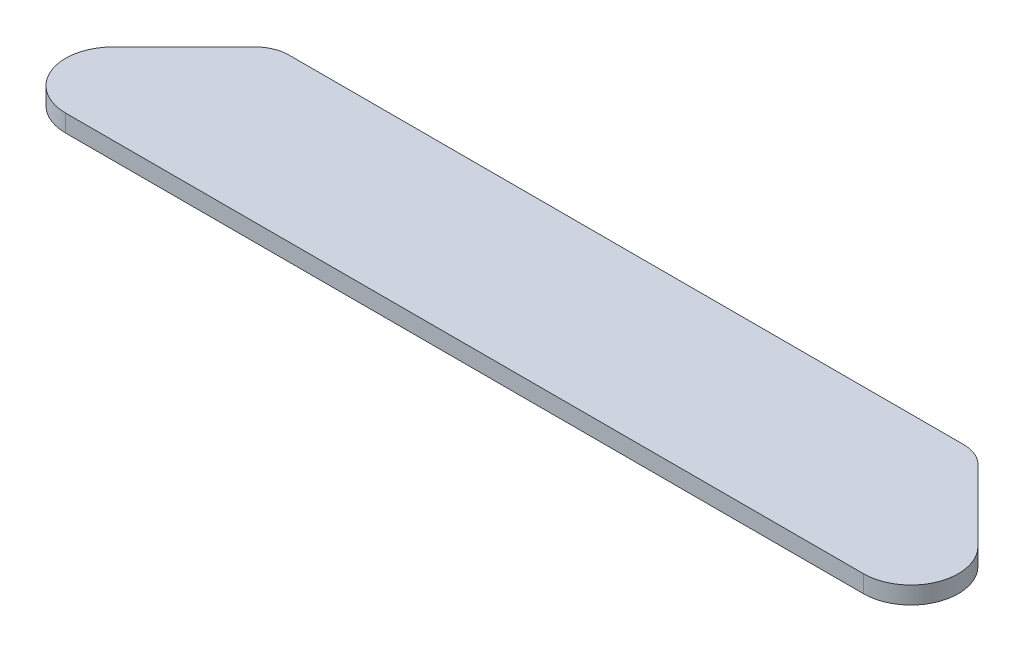
ISO-10303-21;
HEADER;
FILE_DESCRIPTION(('STEP AP214'),'2;1');
FILE_NAME('part.step','',(''),(''),'','','');
FILE_SCHEMA(('AUTOMOTIVE_DESIGN { 1 0 10303 214 1 1 1 1 }'));
ENDSEC;
DATA;
#1=APPLICATION_CONTEXT('core data for automotive mechanical design processes');
#2=APPLICATION_PROTOCOL_DEFINITION('international standard','automotive_design',2000,#1);
#3=PRODUCT_CONTEXT('',#1,'mechanical');
#4=PRODUCT('Part','Part','',(#3));
#5=PRODUCT_RELATED_PRODUCT_CATEGORY('part','',(#4));
#6=PRODUCT_DEFINITION_FORMATION('','',#4);
#7=PRODUCT_DEFINITION_CONTEXT('part definition',#1,'design');
#8=PRODUCT_DEFINITION('design','',#6,#7);
#9=PRODUCT_DEFINITION_SHAPE('','',#8);
#10=(LENGTH_UNIT() NAMED_UNIT(*) SI_UNIT(.MILLI.,.METRE.));
#11=(NAMED_UNIT(*) PLANE_ANGLE_UNIT() SI_UNIT($,.RADIAN.));
#12=(NAMED_UNIT(*) SI_UNIT($,.STERADIAN.) SOLID_ANGLE_UNIT());
#13=UNCERTAINTY_MEASURE_WITH_UNIT(LENGTH_MEASURE(1.E-05),#10,'distance_accuracy_value','');
#14=(GEOMETRIC_REPRESENTATION_CONTEXT(3) GLOBAL_UNCERTAINTY_ASSIGNED_CONTEXT((#13)) GLOBAL_UNIT_ASSIGNED_CONTEXT((#10,
#11,#12)) REPRESENTATION_CONTEXT('',''));
#15=CARTESIAN_POINT('',(0.,0.,0.));
#16=DIRECTION('',(0.,0.,1.));
#17=DIRECTION('',(1.,0.,0.));
#18=AXIS2_PLACEMENT_3D('',#15,#16,#17);
#19=CARTESIAN_POINT('',(-933.90710257734,38.1,58.4000267443762));
#20=DIRECTION('',(0.,-1.,0.));
#21=DIRECTION('',(0.,0.,-1.));
#22=AXIS2_PLACEMENT_3D('',#19,#20,#21);
#23=CYLINDRICAL_SURFACE('',#22,104.14);
#24=CARTESIAN_POINT('',(-933.90710257734,0.,58.4000267443762));
#25=DIRECTION('',(0.,1.,0.));
#26=DIRECTION('',(0.,0.,-1.));
#27=AXIS2_PLACEMENT_3D('',#24,#25,#26);
#28=CIRCLE('',#27,104.14);
#29=CARTESIAN_POINT('',(-1007.54520277011,0.,-15.2380734483907));
#30=VERTEX_POINT('',#29);
#31=CARTESIAN_POINT('',(-933.90710257734,0.,162.540026744376));
#32=VERTEX_POINT('',#31);
#33=EDGE_CURVE('E134',#30,#32,#28,.T.);
#34=ORIENTED_EDGE('',*,*,#33,.T.);
#35=DIRECTION('',(0.,-1.,0.));
#36=VECTOR('',#35,1.);
#37=CARTESIAN_POINT('',(-933.90710257734,38.1,162.540026744376));
#38=LINE('',#37,#36);
#39=CARTESIAN_POINT('',(-933.90710257734,38.1,162.540026744376));
#40=VERTEX_POINT('',#39);
#41=EDGE_CURVE('E41',#40,#32,#38,.T.);
#42=ORIENTED_EDGE('',*,*,#41,.F.);
#43=CARTESIAN_POINT('',(-933.90710257734,38.1,58.4000267443762));
#44=DIRECTION('',(0.,1.,0.));
#45=DIRECTION('',(0.,0.,-1.));
#46=AXIS2_PLACEMENT_3D('',#43,#44,#45);
#47=CIRCLE('',#46,104.14);
#48=CARTESIAN_POINT('',(-1007.54520277011,38.1,-15.2380734483907));
#49=VERTEX_POINT('',#48);
#50=EDGE_CURVE('E93',#49,#40,#47,.T.);
#51=ORIENTED_EDGE('',*,*,#50,.F.);
#52=DIRECTION('',(0.,-1.,0.));
#53=VECTOR('',#52,1.);
#54=CARTESIAN_POINT('',(-1007.54520277011,38.1,-15.2380734483907));
#55=LINE('',#54,#53);
#56=EDGE_CURVE('E11',#49,#30,#55,.T.);
#57=ORIENTED_EDGE('',*,*,#56,.T.);
#58=EDGE_LOOP('',(#34,#42,#51,#57));
#59=FACE_BOUND('',#58,.T.);
#60=ADVANCED_FACE('F33',(#59),#23,.T.);
#61=CARTESIAN_POINT('',(812.279191117721,38.1,162.540026744376));
#62=DIRECTION('',(0.,0.,-1.));
#63=DIRECTION('',(-1.,0.,0.));
#64=AXIS2_PLACEMENT_3D('',#61,#62,#63);
#65=PLANE('',#64);
#66=DIRECTION('',(1.,0.,0.));
#67=VECTOR('',#66,1.);
#68=CARTESIAN_POINT('',(812.279191117721,0.,162.540026744376));
#69=LINE('',#68,#67);
#70=CARTESIAN_POINT('',(818.411293566149,0.,162.540026744376));
#71=VERTEX_POINT('',#70);
#72=EDGE_CURVE('E137',#32,#71,#69,.T.);
#73=ORIENTED_EDGE('',*,*,#72,.T.);
#74=DIRECTION('',(0.,-1.,0.));
#75=VECTOR('',#74,1.);
#76=CARTESIAN_POINT('',(818.411293566149,38.1,162.540026744376));
#77=LINE('',#76,#75);
#78=CARTESIAN_POINT('',(818.411293566149,38.1,162.540026744376));
#79=VERTEX_POINT('',#78);
#80=EDGE_CURVE('E155',#79,#71,#77,.T.);
#81=ORIENTED_EDGE('',*,*,#80,.F.);
#82=DIRECTION('',(1.,0.,0.));
#83=VECTOR('',#82,1.);
#84=CARTESIAN_POINT('',(-927.775000128912,38.1,162.540026744376));
#85=LINE('',#84,#83);
#86=EDGE_CURVE('E162',#40,#79,#85,.T.);
#87=ORIENTED_EDGE('',*,*,#86,.F.);
#88=ORIENTED_EDGE('',*,*,#41,.T.);
#89=EDGE_LOOP('',(#73,#81,#87,#88));
#90=FACE_BOUND('',#89,.T.);
#91=ADVANCED_FACE('F160',(#90),#65,.F.);
#92=CARTESIAN_POINT('',(818.411293566152,38.1,58.4000267443759));
#93=DIRECTION('',(0.,-1.,0.));
#94=DIRECTION('',(0.,0.,-1.));
#95=AXIS2_PLACEMENT_3D('',#92,#93,#94);
#96=CYLINDRICAL_SURFACE('',#95,104.14);
#97=CARTESIAN_POINT('',(818.411293566152,0.,58.4000267443759));
#98=DIRECTION('',(0.,1.,0.));
#99=DIRECTION('',(0.,0.,-1.));
#100=AXIS2_PLACEMENT_3D('',#97,#98,#99);
#101=CIRCLE('',#100,104.14);
#102=CARTESIAN_POINT('',(892.049393758918,0.,-15.2380734483918));
#103=VERTEX_POINT('',#102);
#104=EDGE_CURVE('E140',#71,#103,#101,.T.);
#105=ORIENTED_EDGE('',*,*,#104,.T.);
#106=DIRECTION('',(0.,-1.,0.));
#107=VECTOR('',#106,1.);
#108=CARTESIAN_POINT('',(892.049393758918,38.1,-15.2380734483918));
#109=LINE('',#108,#107);
#110=CARTESIAN_POINT('',(892.049393758918,38.1,-15.2380734483918));
#111=VERTEX_POINT('',#110);
#112=EDGE_CURVE('E152',#111,#103,#109,.T.);
#113=ORIENTED_EDGE('',*,*,#112,.F.);
#114=CARTESIAN_POINT('',(818.411293566152,38.1,58.4000267443759));
#115=DIRECTION('',(0.,1.,0.));
#116=DIRECTION('',(0.,0.,-1.));
#117=AXIS2_PLACEMENT_3D('',#114,#115,#116);
#118=CIRCLE('',#117,104.14);
#119=EDGE_CURVE('E172',#79,#111,#118,.T.);
#120=ORIENTED_EDGE('',*,*,#119,.F.);
#121=ORIENTED_EDGE('',*,*,#80,.T.);
#122=EDGE_LOOP('',(#105,#113,#120,#121));
#123=FACE_BOUND('',#122,.T.);
#124=ADVANCED_FACE('F168',(#123),#96,.T.);
#125=CARTESIAN_POINT('',(892.049393758918,38.1,-15.2380734483918));
#126=DIRECTION('',(-0.707106781186538,0.,0.707106781186557));
#127=DIRECTION('',(0.707106781186557,0.,0.707106781186538));
#128=AXIS2_PLACEMENT_3D('',#125,#126,#127);
#129=PLANE('',#128);
#130=DIRECTION('',(-0.707106781186557,0.,-0.707106781186538));
#131=VECTOR('',#130,1.);
#132=CARTESIAN_POINT('',(892.049393758918,0.,-15.2380734483918));
#133=LINE('',#132,#131);
#134=CARTESIAN_POINT('',(736.545957225267,0.,-170.741509982039));
#135=VERTEX_POINT('',#134);
#136=EDGE_CURVE('E142',#103,#135,#133,.T.);
#137=ORIENTED_EDGE('',*,*,#136,.T.);
#138=DIRECTION('',(0.,-1.,0.));
#139=VECTOR('',#138,1.);
#140=CARTESIAN_POINT('',(736.545957225267,38.1,-170.741509982039));
#141=LINE('',#140,#139);
#142=CARTESIAN_POINT('',(736.545957225267,38.1,-170.741509982039));
#143=VERTEX_POINT('',#142);
#144=EDGE_CURVE('E123',#143,#135,#141,.T.);
#145=ORIENTED_EDGE('',*,*,#144,.F.);
#146=DIRECTION('',(-0.707106781186557,0.,-0.707106781186538));
#147=VECTOR('',#146,1.);
#148=CARTESIAN_POINT('',(892.049393758918,38.1,-15.2380734483918));
#149=LINE('',#148,#147);
#150=EDGE_CURVE('E113',#111,#143,#149,.T.);
#151=ORIENTED_EDGE('',*,*,#150,.F.);
#152=ORIENTED_EDGE('',*,*,#112,.T.);
#153=EDGE_LOOP('',(#137,#145,#151,#152));
#154=FACE_BOUND('',#153,.T.);
#155=ADVANCED_FACE('F171',(#154),#129,.F.);
#156=CARTESIAN_POINT('',(682.664420498853,38.1,-116.859973255624));
#157=DIRECTION('',(0.,-1.,0.));
#158=DIRECTION('',(0.,0.,-1.));
#159=AXIS2_PLACEMENT_3D('',#156,#157,#158);
#160=CYLINDRICAL_SURFACE('',#159,76.1999999999997);
#161=CARTESIAN_POINT('',(682.664420498853,0.,-116.859973255624));
#162=DIRECTION('',(0.,1.,0.));
#163=DIRECTION('',(0.,0.,-1.));
#164=AXIS2_PLACEMENT_3D('',#161,#162,#163);
#165=CIRCLE('',#164,76.1999999999997);
#166=CARTESIAN_POINT('',(682.664420498853,0.,-193.059973255624));
#167=VERTEX_POINT('',#166);
#168=EDGE_CURVE('E122',#135,#167,#165,.T.);
#169=ORIENTED_EDGE('',*,*,#168,.T.);
#170=DIRECTION('',(0.,-1.,0.));
#171=VECTOR('',#170,1.);
#172=CARTESIAN_POINT('',(682.664420498853,38.1,-193.059973255624));
#173=LINE('',#172,#171);
#174=CARTESIAN_POINT('',(682.664420498853,38.1,-193.059973255624));
#175=VERTEX_POINT('',#174);
#176=EDGE_CURVE('E119',#175,#167,#173,.T.);
#177=ORIENTED_EDGE('',*,*,#176,.F.);
#178=CARTESIAN_POINT('',(682.664420498853,38.1,-116.859973255624));
#179=DIRECTION('',(0.,1.,0.));
#180=DIRECTION('',(0.,0.,-1.));
#181=AXIS2_PLACEMENT_3D('',#178,#179,#180);
#182=CIRCLE('',#181,76.1999999999997);
#183=EDGE_CURVE('E107',#143,#175,#182,.T.);
#184=ORIENTED_EDGE('',*,*,#183,.F.);
#185=ORIENTED_EDGE('',*,*,#144,.T.);
#186=EDGE_LOOP('',(#169,#177,#184,#185));
#187=FACE_BOUND('',#186,.T.);
#188=ADVANCED_FACE('F120',(#187),#160,.T.);
#189=CARTESIAN_POINT('',(-752.465886730173,38.1,-193.059973255624));
#190=DIRECTION('',(0.,0.,1.));
#191=DIRECTION('',(1.,0.,0.));
#192=AXIS2_PLACEMENT_3D('',#189,#190,#191);
#193=PLANE('',#192);
#194=DIRECTION('',(-1.,0.,0.));
#195=VECTOR('',#194,1.);
#196=CARTESIAN_POINT('',(-752.465886730173,0.,-193.059973255624));
#197=LINE('',#196,#195);
#198=CARTESIAN_POINT('',(-799.212331958472,0.,-193.059973255623));
#199=VERTEX_POINT('',#198);
#200=EDGE_CURVE('E78',#167,#199,#197,.T.);
#201=ORIENTED_EDGE('',*,*,#200,.T.);
#202=DIRECTION('',(0.,-1.,0.));
#203=VECTOR('',#202,1.);
#204=CARTESIAN_POINT('',(-799.212331958472,38.1,-193.059973255623));
#205=LINE('',#204,#203);
#206=CARTESIAN_POINT('',(-799.212331958472,38.1,-193.059973255623));
#207=VERTEX_POINT('',#206);
#208=EDGE_CURVE('E124',#207,#199,#205,.T.);
#209=ORIENTED_EDGE('',*,*,#208,.F.);
#210=DIRECTION('',(-1.,0.,0.));
#211=VECTOR('',#210,1.);
#212=CARTESIAN_POINT('',(636.97007771898,38.1,-193.059973255624));
#213=LINE('',#212,#211);
#214=EDGE_CURVE('E111',#175,#207,#213,.T.);
#215=ORIENTED_EDGE('',*,*,#214,.F.);
#216=ORIENTED_EDGE('',*,*,#176,.T.);
#217=EDGE_LOOP('',(#201,#209,#215,#216));
#218=FACE_BOUND('',#217,.T.);
#219=ADVANCED_FACE('F126',(#218),#193,.F.);
#220=CARTESIAN_POINT('',(-799.212331958473,38.1,-119.399973255624));
#221=DIRECTION('',(0.,-1.,0.));
#222=DIRECTION('',(0.,0.,-1.));
#223=AXIS2_PLACEMENT_3D('',#220,#221,#222);
#224=CYLINDRICAL_SURFACE('',#223,73.659999999999);
#225=CARTESIAN_POINT('',(-799.212331958473,0.,-119.399973255624));
#226=DIRECTION('',(0.,1.,0.));
#227=DIRECTION('',(0.,0.,-1.));
#228=AXIS2_PLACEMENT_3D('',#225,#226,#227);
#229=CIRCLE('',#228,73.659999999999);
#230=CARTESIAN_POINT('',(-851.297817460673,0.,-171.485458757824));
#231=VERTEX_POINT('',#230);
#232=EDGE_CURVE('E146',#199,#231,#229,.T.);
#233=ORIENTED_EDGE('',*,*,#232,.T.);
#234=DIRECTION('',(0.,-1.,0.));
#235=VECTOR('',#234,1.);
#236=CARTESIAN_POINT('',(-851.297817460673,38.1,-171.485458757824));
#237=LINE('',#236,#235);
#238=CARTESIAN_POINT('',(-851.297817460673,38.1,-171.485458757824));
#239=VERTEX_POINT('',#238);
#240=EDGE_CURVE('E130',#239,#231,#237,.T.);
#241=ORIENTED_EDGE('',*,*,#240,.F.);
#242=CARTESIAN_POINT('',(-799.212331958473,38.1,-119.399973255624));
#243=DIRECTION('',(0.,1.,0.));
#244=DIRECTION('',(0.,0.,-1.));
#245=AXIS2_PLACEMENT_3D('',#242,#243,#244);
#246=CIRCLE('',#245,73.659999999999);
#247=EDGE_CURVE('E128',#207,#239,#246,.T.);
#248=ORIENTED_EDGE('',*,*,#247,.F.);
#249=ORIENTED_EDGE('',*,*,#208,.T.);
#250=EDGE_LOOP('',(#233,#241,#248,#249));
#251=FACE_BOUND('',#250,.T.);
#252=ADVANCED_FACE('F230',(#251),#224,.T.);
#253=CARTESIAN_POINT('',(-1003.20915154589,38.1,-19.5741246726044));
#254=DIRECTION('',(0.707106781186545,0.,0.70710678118655));
#255=DIRECTION('',(0.70710678118655,0.,-0.707106781186545));
#256=AXIS2_PLACEMENT_3D('',#253,#254,#255);
#257=PLANE('',#256);
#258=DIRECTION('',(-0.70710678118655,0.,0.707106781186545));
#259=VECTOR('',#258,1.);
#260=CARTESIAN_POINT('',(-1003.20915154589,0.,-19.5741246726044));
#261=LINE('',#260,#259);
#262=EDGE_CURVE('E85',#231,#30,#261,.T.);
#263=ORIENTED_EDGE('',*,*,#262,.T.);
#264=ORIENTED_EDGE('',*,*,#56,.F.);
#265=DIRECTION('',(-0.707106781186548,0.,0.707106781186548));
#266=VECTOR('',#265,1.);
#267=CARTESIAN_POINT('',(-1007.54520277011,38.1,-15.2380734483908));
#268=LINE('',#267,#266);
#269=EDGE_CURVE('E49',#239,#49,#268,.T.);
#270=ORIENTED_EDGE('',*,*,#269,.F.);
#271=ORIENTED_EDGE('',*,*,#240,.T.);
#272=EDGE_LOOP('',(#263,#264,#270,#271));
#273=FACE_BOUND('',#272,.T.);
#274=ADVANCED_FACE('F233',(#273),#257,.F.);
#275=CARTESIAN_POINT('',(-799.212331958473,38.1,-119.399973255624));
#276=DIRECTION('',(0.,-1.,0.));
#277=DIRECTION('',(0.,0.,-1.));
#278=AXIS2_PLACEMENT_3D('',#275,#276,#277);
#279=PLANE('',#278);
#280=ORIENTED_EDGE('',*,*,#269,.T.);
#281=ORIENTED_EDGE('',*,*,#50,.T.);
#282=ORIENTED_EDGE('',*,*,#86,.T.);
#283=ORIENTED_EDGE('',*,*,#119,.T.);
#284=ORIENTED_EDGE('',*,*,#150,.T.);
#285=ORIENTED_EDGE('',*,*,#183,.T.);
#286=ORIENTED_EDGE('',*,*,#214,.T.);
#287=ORIENTED_EDGE('',*,*,#247,.T.);
#288=EDGE_LOOP('',(#280,#281,#282,#283,#284,#285,#286,#287));
#289=FACE_BOUND('',#288,.T.);
#290=ADVANCED_FACE('F109',(#289),#279,.F.);
#291=CARTESIAN_POINT('',(-799.212331958473,0.,-119.399973255624));
#292=DIRECTION('',(0.,-1.,0.));
#293=DIRECTION('',(0.,0.,-1.));
#294=AXIS2_PLACEMENT_3D('',#291,#292,#293);
#295=PLANE('',#294);
#296=CARTESIAN_POINT('',(513.611293566152,0.,58.4000267443762));
#297=DIRECTION('',(0.,-1.,0.));
#298=DIRECTION('',(0.,0.,-1.));
#299=AXIS2_PLACEMENT_3D('',#296,#297,#298);
#300=CIRCLE('',#299,12.7);
#301=CARTESIAN_POINT('',(513.611293566152,0.,45.7000267443762));
#302=VERTEX_POINT('',#301);
#303=EDGE_CURVE('E184',#302,#302,#300,.T.);
#304=ORIENTED_EDGE('',*,*,#303,.F.);
#305=EDGE_LOOP('',(#304));
#306=FACE_BOUND('',#305,.T.);
#307=CARTESIAN_POINT('',(-629.10710257734,0.,58.4000267443762));
#308=DIRECTION('',(0.,-1.,0.));
#309=DIRECTION('',(0.,0.,-1.));
#310=AXIS2_PLACEMENT_3D('',#307,#308,#309);
#311=CIRCLE('',#310,12.7);
#312=CARTESIAN_POINT('',(-629.10710257734,0.,45.7000267443762));
#313=VERTEX_POINT('',#312);
#314=EDGE_CURVE('E178',#313,#313,#311,.T.);
#315=ORIENTED_EDGE('',*,*,#314,.F.);
#316=EDGE_LOOP('',(#315));
#317=FACE_BOUND('',#316,.T.);
#318=ORIENTED_EDGE('',*,*,#33,.F.);
#319=ORIENTED_EDGE('',*,*,#262,.F.);
#320=ORIENTED_EDGE('',*,*,#232,.F.);
#321=ORIENTED_EDGE('',*,*,#200,.F.);
#322=ORIENTED_EDGE('',*,*,#168,.F.);
#323=ORIENTED_EDGE('',*,*,#136,.F.);
#324=ORIENTED_EDGE('',*,*,#104,.F.);
#325=ORIENTED_EDGE('',*,*,#72,.F.);
#326=EDGE_LOOP('',(#318,#319,#320,#321,#322,#323,#324,#325));
#327=FACE_BOUND('',#326,.T.);
#328=ADVANCED_FACE('F163',(#306,#317,#327),#295,.T.);
#329=CARTESIAN_POINT('',(-629.10710257734,12.7,58.4000267443762));
#330=DIRECTION('',(0.,-1.,0.));
#331=DIRECTION('',(0.,0.,-1.));
#332=AXIS2_PLACEMENT_3D('',#329,#330,#331);
#333=CYLINDRICAL_SURFACE('',#332,12.7);
#334=CARTESIAN_POINT('',(-629.10710257734,12.7,58.4000267443762));
#335=DIRECTION('',(0.,-1.,0.));
#336=DIRECTION('',(0.,0.,-1.));
#337=AXIS2_PLACEMENT_3D('',#334,#335,#336);
#338=CIRCLE('',#337,12.7);
#339=CARTESIAN_POINT('',(-629.10710257734,12.7,45.7000267443762));
#340=VERTEX_POINT('',#339);
#341=EDGE_CURVE('E138',#340,#340,#338,.T.);
#342=ORIENTED_EDGE('',*,*,#341,.F.);
#343=EDGE_LOOP('',(#342));
#344=FACE_BOUND('',#343,.T.);
#345=ORIENTED_EDGE('',*,*,#314,.T.);
#346=EDGE_LOOP('',(#345));
#347=FACE_BOUND('',#346,.T.);
#348=ADVANCED_FACE('F201',(#344,#347),#333,.F.);
#349=CARTESIAN_POINT('',(-629.10710257734,12.7,58.4000267443762));
#350=DIRECTION('',(0.,-1.,0.));
#351=DIRECTION('',(0.,0.,-1.));
#352=AXIS2_PLACEMENT_3D('',#349,#350,#351);
#353=PLANE('',#352);
#354=ORIENTED_EDGE('',*,*,#341,.T.);
#355=EDGE_LOOP('',(#354));
#356=FACE_BOUND('',#355,.T.);
#357=ADVANCED_FACE('F195',(#356),#353,.T.);
#358=CARTESIAN_POINT('',(513.611293566152,12.7,58.4000267443762));
#359=DIRECTION('',(0.,-1.,0.));
#360=DIRECTION('',(0.,0.,-1.));
#361=AXIS2_PLACEMENT_3D('',#358,#359,#360);
#362=CYLINDRICAL_SURFACE('',#361,12.7);
#363=CARTESIAN_POINT('',(513.611293566152,12.7,58.4000267443762));
#364=DIRECTION('',(0.,-1.,0.));
#365=DIRECTION('',(0.,0.,-1.));
#366=AXIS2_PLACEMENT_3D('',#363,#364,#365);
#367=CIRCLE('',#366,12.7);
#368=CARTESIAN_POINT('',(513.611293566152,12.7,45.7000267443762));
#369=VERTEX_POINT('',#368);
#370=EDGE_CURVE('E181',#369,#369,#367,.T.);
#371=ORIENTED_EDGE('',*,*,#370,.F.);
#372=EDGE_LOOP('',(#371));
#373=FACE_BOUND('',#372,.T.);
#374=ORIENTED_EDGE('',*,*,#303,.T.);
#375=EDGE_LOOP('',(#374));
#376=FACE_BOUND('',#375,.T.);
#377=ADVANCED_FACE('F192',(#373,#376),#362,.F.);
#378=CARTESIAN_POINT('',(513.611293566152,12.7,58.4000267443762));
#379=DIRECTION('',(0.,-1.,0.));
#380=DIRECTION('',(0.,0.,-1.));
#381=AXIS2_PLACEMENT_3D('',#378,#379,#380);
#382=PLANE('',#381);
#383=ORIENTED_EDGE('',*,*,#370,.T.);
#384=EDGE_LOOP('',(#383));
#385=FACE_BOUND('',#384,.T.);
#386=ADVANCED_FACE('F190',(#385),#382,.T.);
#387=CLOSED_SHELL('',(#60,#91,#124,#155,#188,#219,#252,#274,#290,#328,#348,#357,#377,#386));
#388=MANIFOLD_SOLID_BREP('B2',#387);
#389=ADVANCED_BREP_SHAPE_REPRESENTATION('',(#18,#388),#14);
#390=SHAPE_DEFINITION_REPRESENTATION(#9,#389);
ENDSEC;
END-ISO-10303-21;
